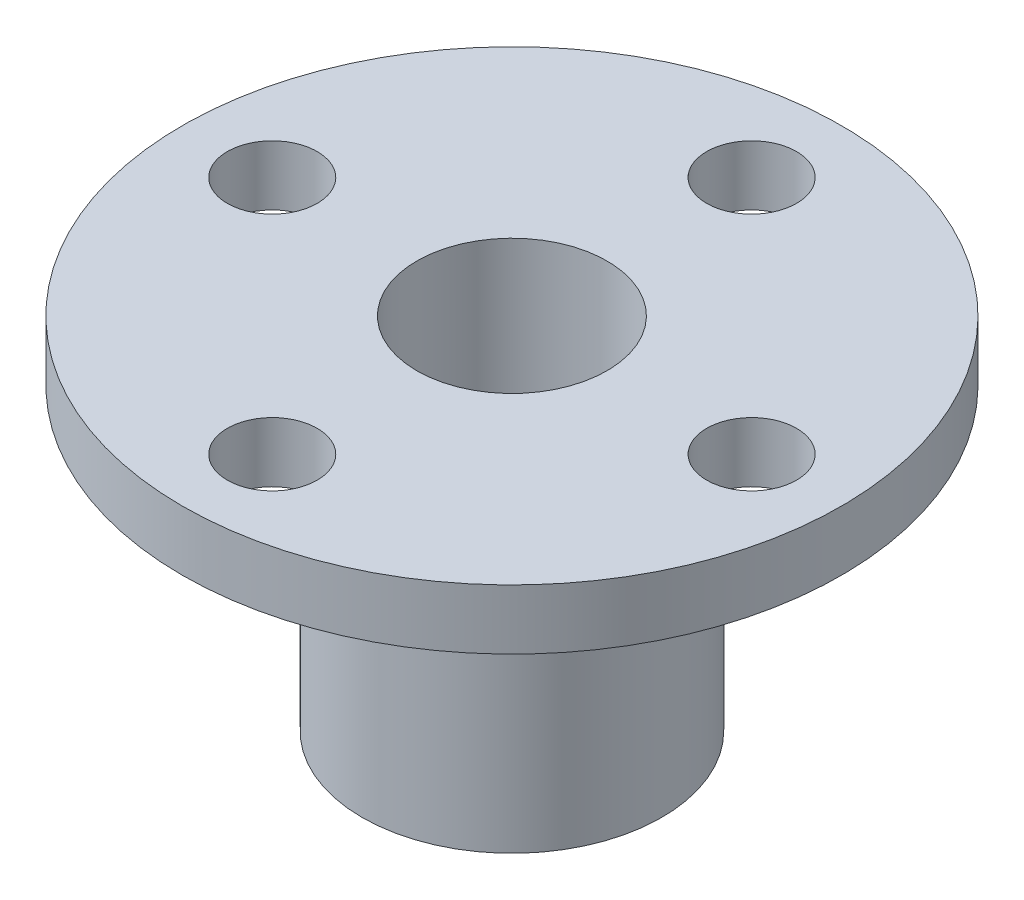
ISO-10303-21;
HEADER;
FILE_DESCRIPTION(('STEP AP214'),'2;1');
FILE_NAME('part.step','',(''),(''),'','','');
FILE_SCHEMA(('AUTOMOTIVE_DESIGN { 1 0 10303 214 1 1 1 1 }'));
ENDSEC;
DATA;
#1=APPLICATION_CONTEXT('core data for automotive mechanical design processes');
#2=APPLICATION_PROTOCOL_DEFINITION('international standard','automotive_design',2000,#1);
#3=PRODUCT_CONTEXT('',#1,'mechanical');
#4=PRODUCT('Part','Part','',(#3));
#5=PRODUCT_RELATED_PRODUCT_CATEGORY('part','',(#4));
#6=PRODUCT_DEFINITION_FORMATION('','',#4);
#7=PRODUCT_DEFINITION_CONTEXT('part definition',#1,'design');
#8=PRODUCT_DEFINITION('design','',#6,#7);
#9=PRODUCT_DEFINITION_SHAPE('','',#8);
#10=(LENGTH_UNIT() NAMED_UNIT(*) SI_UNIT(.MILLI.,.METRE.));
#11=(NAMED_UNIT(*) PLANE_ANGLE_UNIT() SI_UNIT($,.RADIAN.));
#12=(NAMED_UNIT(*) SI_UNIT($,.STERADIAN.) SOLID_ANGLE_UNIT());
#13=UNCERTAINTY_MEASURE_WITH_UNIT(LENGTH_MEASURE(1.E-05),#10,'distance_accuracy_value','');
#14=(GEOMETRIC_REPRESENTATION_CONTEXT(3) GLOBAL_UNCERTAINTY_ASSIGNED_CONTEXT((#13)) GLOBAL_UNIT_ASSIGNED_CONTEXT((#10,
#11,#12)) REPRESENTATION_CONTEXT('',''));
#15=CARTESIAN_POINT('',(0.,0.,0.));
#16=DIRECTION('',(0.,0.,1.));
#17=DIRECTION('',(1.,0.,0.));
#18=AXIS2_PLACEMENT_3D('',#15,#16,#17);
#19=CARTESIAN_POINT('',(0.,12.,0.));
#20=DIRECTION('',(0.,-1.,0.));
#21=DIRECTION('',(0.,0.,-1.));
#22=AXIS2_PLACEMENT_3D('',#19,#20,#21);
#23=CYLINDRICAL_SURFACE('',#22,5.);
#24=CARTESIAN_POINT('',(-2.31202417441306,3.500000112,-4.43334458585497));
#25=CARTESIAN_POINT('',(-2.31202549942293,3.58219466243882,-4.43334446318807));
#26=CARTESIAN_POINT('',(-2.31833638489113,3.6643993411338,-4.43006995781901));
#27=CARTESIAN_POINT('',(-2.34321559717994,3.82640537148671,-4.41695966316735));
#28=CARTESIAN_POINT('',(-2.36178801955003,3.90620591080794,-4.40712168156711));
#29=CARTESIAN_POINT('',(-2.41012639449827,4.06103485724733,-4.38087199438878));
#30=CARTESIAN_POINT('',(-2.43987372797232,4.13607096086672,-4.36447122047532));
#31=CARTESIAN_POINT('',(-2.50910127555069,4.27962206956173,-4.32504236855152));
#32=CARTESIAN_POINT('',(-2.5485829466275,4.34813609632548,-4.30201329837435));
#33=CARTESIAN_POINT('',(-2.636816060183,4.47886653233031,-4.24852112305575));
#34=CARTESIAN_POINT('',(-2.68580083537678,4.5408460417147,-4.21786379492083));
#35=CARTESIAN_POINT('',(-2.79025208635728,4.65463809882842,-4.14950403477006));
#36=CARTESIAN_POINT('',(-2.84571939385381,4.70644933967767,-4.1118006983778));
#37=CARTESIAN_POINT('',(-2.96222634925548,4.79946285226967,-4.02870100905597));
#38=CARTESIAN_POINT('',(-3.02335751045674,4.84042357834181,-3.98316169150373));
#39=CARTESIAN_POINT('',(-3.14784118309348,4.9089874154291,-3.88552985734805));
#40=CARTESIAN_POINT('',(-3.21119321228797,4.93659340726878,-3.83343875712392));
#41=CARTESIAN_POINT('',(-3.33595485274791,4.9768801600074,-3.72532159422989));
#42=CARTESIAN_POINT('',(-3.39736818700763,4.98996528708777,-3.66945072405293));
#43=CARTESIAN_POINT('',(-3.51800486213996,5.0021174846796,-3.55395675397155));
#44=CARTESIAN_POINT('',(-3.57722866037419,5.0011874995153,-3.49433444479822));
#45=CARTESIAN_POINT('',(-3.68987212284126,4.98560729131133,-3.37510896758464));
#46=CARTESIAN_POINT('',(-3.74341656555431,4.97139496574636,-3.31556566237646));
#47=CARTESIAN_POINT('',(-3.84553266225358,4.93036882262428,-3.19656529599339));
#48=CARTESIAN_POINT('',(-3.89410400108437,4.90355420703632,-3.1371082405194));
#49=CARTESIAN_POINT('',(-3.98596060909705,4.83778813294174,-3.01956152576072));
#50=CARTESIAN_POINT('',(-4.02917772174205,4.79869895256468,-2.96149585841079));
#51=CARTESIAN_POINT('',(-4.10918213174248,4.70960230066398,-2.84945061349041));
#52=CARTESIAN_POINT('',(-4.14596789992589,4.65959223883712,-2.79547200942037));
#53=CARTESIAN_POINT('',(-4.21419803162387,4.54780239800341,-2.691570132292));
#54=CARTESIAN_POINT('',(-4.24538182840745,4.48564322793666,-2.64188339808442));
#55=CARTESIAN_POINT('',(-4.30056428791281,4.35249012518576,-2.55107384986256));
#56=CARTESIAN_POINT('',(-4.32456223664918,4.28149531558445,-2.50995188696694));
#57=CARTESIAN_POINT('',(-4.36562000216245,4.13176066713603,-2.43784893375301));
#58=CARTESIAN_POINT('',(-4.3826110813607,4.05295308802471,-2.40696896818131));
#59=CARTESIAN_POINT('',(-4.40937475906003,3.8903929202142,-2.35758610040724));
#60=CARTESIAN_POINT('',(-4.41914971248739,3.8066419543949,-2.33907916055082));
#61=CARTESIAN_POINT('',(-4.43129411113088,3.63991775988073,-2.31598735677623));
#62=CARTESIAN_POINT('',(-4.43392599968392,3.55703189415707,-2.31090929044338));
#63=CARTESIAN_POINT('',(-4.43254936639928,3.39152721287025,-2.31354901107095));
#64=CARTESIAN_POINT('',(-4.42854177409488,3.3089083615473,-2.32126500685131));
#65=CARTESIAN_POINT('',(-4.41406688537284,3.1485117274029,-2.34866782198895));
#66=CARTESIAN_POINT('',(-4.40377010820637,3.07066393880063,-2.36803844773727));
#67=CARTESIAN_POINT('',(-4.37683344831705,2.91959840772447,-2.41746060562369));
#68=CARTESIAN_POINT('',(-4.36019258619421,2.84638138218371,-2.4475137868865));
#69=CARTESIAN_POINT('',(-4.31998197247072,2.70448262779798,-2.51782310486844));
#70=CARTESIAN_POINT('',(-4.29623823884611,2.63597536865816,-2.55833143685246));
#71=CARTESIAN_POINT('',(-4.24195840239585,2.50736197920264,-2.64735757745196));
#72=CARTESIAN_POINT('',(-4.21142067347663,2.44725786573648,-2.69587730281841));
#73=CARTESIAN_POINT('',(-4.14229622234859,2.33481967346355,-2.80097805981982));
#74=CARTESIAN_POINT('',(-4.10344922355428,2.28286444829127,-2.85779422020612));
#75=CARTESIAN_POINT('',(-4.01870727216013,2.19103337259757,-2.97577877246632));
#76=CARTESIAN_POINT('',(-3.97281266974601,2.15115692219098,-3.03694694801359));
#77=CARTESIAN_POINT('',(-3.87494178797113,2.08500003850884,-3.16085511688787));
#78=CARTESIAN_POINT('',(-3.82301465542071,2.05861805167433,-3.22357952970589));
#79=CARTESIAN_POINT('',(-3.7138590071855,2.01993914691165,-3.34875151800136));
#80=CARTESIAN_POINT('',(-3.65663201336301,2.00763819906583,-3.41119916758784));
#81=CARTESIAN_POINT('',(-3.54070823169406,1.99777701991018,-3.53130065564012));
#82=CARTESIAN_POINT('',(-3.48215291350954,1.9996673682435,-3.58904649265504));
#83=CARTESIAN_POINT('',(-3.36332028582923,2.01682169592389,-3.70063777193117));
#84=CARTESIAN_POINT('',(-3.30304307415707,2.0320849169919,-3.75448343515565));
#85=CARTESIAN_POINT('',(-3.18337766053787,2.07521172544236,-3.85645255363714));
#86=CARTESIAN_POINT('',(-3.12398686280542,2.10293824511586,-3.90463124709361));
#87=CARTESIAN_POINT('',(-3.00739314670923,2.17008198014908,-3.99512692528447));
#88=CARTESIAN_POINT('',(-2.95019058963226,2.20950111667913,-4.03744294506723));
#89=CARTESIAN_POINT('',(-2.83814117386164,2.30037352572427,-4.11701720553163));
#90=CARTESIAN_POINT('',(-2.78342825653659,2.35217149947148,-4.15407028684386));
#91=CARTESIAN_POINT('',(-2.68042809577496,2.46571046048475,-4.22126694611445));
#92=CARTESIAN_POINT('',(-2.63214271041002,2.52745431155503,-4.25140852790744));
#93=CARTESIAN_POINT('',(-2.54264572526368,2.66134085549778,-4.30555164221764));
#94=CARTESIAN_POINT('',(-2.50168784776831,2.73373863263396,-4.3293433991486));
#95=CARTESIAN_POINT('',(-2.43066703634383,2.8855552578498,-4.36961488943567));
#96=CARTESIAN_POINT('',(-2.40059886780211,2.96497070967923,-4.3860981368019));
#97=CARTESIAN_POINT('',(-2.35555560514324,3.11974052386268,-4.41043544590183));
#98=CARTESIAN_POINT('',(-2.33930220041448,3.19460874302033,-4.41902859408629));
#99=CARTESIAN_POINT('',(-2.31753694234156,3.34631532644478,-4.43048264682537));
#100=CARTESIAN_POINT('',(-2.31202293561082,3.42315329262089,-4.43334470054093));
#101=CARTESIAN_POINT('',(-2.31202417441306,3.500000112,-4.43334458585497));
#102=B_SPLINE_CURVE_WITH_KNOTS('',3,(#24,#25,#26,#27,#28,#29,#30,#31,#32,#33,#34,#35,#36,#37,
#38,#39,#40,#41,#42,#43,#44,#45,#46,#47,#48,#49,#50,#51,#52,#53,#54,#55,#56,#57,#58,#59,#60,#61,
#62,#63,#64,#65,#66,#67,#68,#69,#70,#71,#72,#73,#74,#75,#76,#77,#78,#79,#80,#81,#82,#83,#84,#85,
#86,#87,#88,#89,#90,#91,#92,#93,#94,#95,#96,#97,#98,#99,#100,#101),.UNSPECIFIED.,.T.,.F.,(4,2,2,
2,2,2,2,2,2,2,2,2,2,2,2,2,2,2,2,2,2,2,2,2,2,2,2,2,2,2,2,2,2,2,2,2,2,2,4),(0.,0.246300173389645,
0.492682656627625,0.738656436837478,0.984667055180276,1.23773153799973,1.49082852474544,
1.74915944741594,2.00743461919942,2.25832147276752,2.50915562023271,2.75200134631458,
2.99486245249785,3.2405521943363,3.48630027427801,3.7415215868586,3.99676824980476,
4.25446251598277,4.51207264842904,4.76008095778362,5.00805454868627,5.24958611399404,
5.49115498205993,5.73920749722107,5.98731944594718,6.24479525616393,6.50225827690007,
6.75775413026906,7.01317684380285,7.25876326723042,7.504335766126,7.747271211504,
7.99024659483157,8.24099652819104,8.49181879167775,8.75011667065351,9.00829022219503,
9.23861183319295,9.46888725700718),.UNSPECIFIED.);
#103=CARTESIAN_POINT('',(-2.31202417441306,3.500000112,-4.43334458585497));
#104=VERTEX_POINT('',#103);
#105=EDGE_CURVE('E92',#104,#104,#102,.T.);
#106=ORIENTED_EDGE('',*,*,#105,.T.);
#107=EDGE_LOOP('',(#106));
#108=FACE_BOUND('',#107,.T.);
#109=CARTESIAN_POINT('',(0.,0.,0.));
#110=DIRECTION('',(0.,1.,0.));
#111=DIRECTION('',(0.,0.,1.));
#112=AXIS2_PLACEMENT_3D('',#109,#110,#111);
#113=CIRCLE('',#112,5.);
#114=CARTESIAN_POINT('',(0.,0.,5.));
#115=VERTEX_POINT('',#114);
#116=EDGE_CURVE('E51',#115,#115,#113,.T.);
#117=ORIENTED_EDGE('',*,*,#116,.T.);
#118=EDGE_LOOP('',(#117));
#119=FACE_BOUND('',#118,.T.);
#120=CARTESIAN_POINT('',(0.,9.999999936,0.));
#121=DIRECTION('',(0.,1.,0.));
#122=DIRECTION('',(0.,0.,1.));
#123=AXIS2_PLACEMENT_3D('',#120,#121,#122);
#124=CIRCLE('',#123,5.);
#125=CARTESIAN_POINT('',(0.,9.999999936,5.));
#126=VERTEX_POINT('',#125);
#127=EDGE_CURVE('E10',#126,#126,#124,.T.);
#128=ORIENTED_EDGE('',*,*,#127,.F.);
#129=EDGE_LOOP('',(#128));
#130=FACE_BOUND('',#129,.T.);
#131=ADVANCED_FACE('F38',(#108,#119,#130),#23,.T.);
#132=CARTESIAN_POINT('',(0.,12.,0.));
#133=DIRECTION('',(0.,1.,0.));
#134=DIRECTION('',(0.,0.,1.));
#135=AXIS2_PLACEMENT_3D('',#132,#133,#134);
#136=PLANE('',#135);
#137=CARTESIAN_POINT('',(0.,12.,-8.));
#138=DIRECTION('',(0.,1.,0.));
#139=DIRECTION('',(0.,0.,1.));
#140=AXIS2_PLACEMENT_3D('',#137,#138,#139);
#141=CIRCLE('',#140,1.5);
#142=CARTESIAN_POINT('',(0.,12.,-6.5));
#143=VERTEX_POINT('',#142);
#144=EDGE_CURVE('E72',#143,#143,#141,.T.);
#145=ORIENTED_EDGE('',*,*,#144,.F.);
#146=EDGE_LOOP('',(#145));
#147=FACE_BOUND('',#146,.T.);
#148=CARTESIAN_POINT('',(8.00000000000023,12.,-2.25861965896257E-13));
#149=DIRECTION('',(0.,1.,0.));
#150=DIRECTION('',(0.,0.,1.));
#151=AXIS2_PLACEMENT_3D('',#148,#149,#150);
#152=CIRCLE('',#151,1.50000000000018);
#153=CARTESIAN_POINT('',(8.00000000000023,12.,1.49999999999995));
#154=VERTEX_POINT('',#153);
#155=EDGE_CURVE('E95',#154,#154,#152,.T.);
#156=ORIENTED_EDGE('',*,*,#155,.F.);
#157=EDGE_LOOP('',(#156));
#158=FACE_BOUND('',#157,.T.);
#159=CARTESIAN_POINT('',(4.52091325832258E-13,12.,8.));
#160=DIRECTION('',(0.,1.,0.));
#161=DIRECTION('',(0.,0.,1.));
#162=AXIS2_PLACEMENT_3D('',#159,#160,#161);
#163=CIRCLE('',#162,1.50000000000049);
#164=CARTESIAN_POINT('',(4.52091325832258E-13,12.,9.50000000000048));
#165=VERTEX_POINT('',#164);
#166=EDGE_CURVE('E91',#165,#165,#163,.T.);
#167=ORIENTED_EDGE('',*,*,#166,.F.);
#168=EDGE_LOOP('',(#167));
#169=FACE_BOUND('',#168,.T.);
#170=CARTESIAN_POINT('',(-7.99999999999977,12.,2.26841683335575E-13));
#171=DIRECTION('',(0.,1.,0.));
#172=DIRECTION('',(0.,0.,1.));
#173=AXIS2_PLACEMENT_3D('',#170,#171,#172);
#174=CIRCLE('',#173,1.50000000000036);
#175=CARTESIAN_POINT('',(-7.99999999999977,12.,1.50000000000059));
#176=VERTEX_POINT('',#175);
#177=EDGE_CURVE('E88',#176,#176,#174,.T.);
#178=ORIENTED_EDGE('',*,*,#177,.F.);
#179=EDGE_LOOP('',(#178));
#180=FACE_BOUND('',#179,.T.);
#181=CARTESIAN_POINT('',(0.,12.,0.));
#182=DIRECTION('',(0.,1.,0.));
#183=DIRECTION('',(0.,0.,1.));
#184=AXIS2_PLACEMENT_3D('',#181,#182,#183);
#185=CIRCLE('',#184,3.175);
#186=CARTESIAN_POINT('',(0.,12.,3.175));
#187=VERTEX_POINT('',#186);
#188=EDGE_CURVE('E56',#187,#187,#185,.T.);
#189=ORIENTED_EDGE('',*,*,#188,.F.);
#190=EDGE_LOOP('',(#189));
#191=FACE_BOUND('',#190,.T.);
#192=CARTESIAN_POINT('',(0.,12.,0.));
#193=DIRECTION('',(0.,1.,0.));
#194=DIRECTION('',(0.,0.,1.));
#195=AXIS2_PLACEMENT_3D('',#192,#193,#194);
#196=CIRCLE('',#195,11.);
#197=CARTESIAN_POINT('',(0.,12.,11.));
#198=VERTEX_POINT('',#197);
#199=EDGE_CURVE('E60',#198,#198,#196,.T.);
#200=ORIENTED_EDGE('',*,*,#199,.T.);
#201=EDGE_LOOP('',(#200));
#202=FACE_BOUND('',#201,.T.);
#203=ADVANCED_FACE('F137',(#147,#158,#169,#180,#191,#202),#136,.T.);
#204=CARTESIAN_POINT('',(0.,0.,0.));
#205=DIRECTION('',(0.,1.,0.));
#206=DIRECTION('',(0.,0.,1.));
#207=AXIS2_PLACEMENT_3D('',#204,#205,#206);
#208=PLANE('',#207);
#209=ORIENTED_EDGE('',*,*,#116,.F.);
#210=EDGE_LOOP('',(#209));
#211=FACE_BOUND('',#210,.T.);
#212=CARTESIAN_POINT('',(0.,0.,0.));
#213=DIRECTION('',(0.,1.,0.));
#214=DIRECTION('',(0.,0.,1.));
#215=AXIS2_PLACEMENT_3D('',#212,#213,#214);
#216=CIRCLE('',#215,3.175);
#217=CARTESIAN_POINT('',(0.,0.,3.175));
#218=VERTEX_POINT('',#217);
#219=EDGE_CURVE('E64',#218,#218,#216,.T.);
#220=ORIENTED_EDGE('',*,*,#219,.T.);
#221=EDGE_LOOP('',(#220));
#222=FACE_BOUND('',#221,.T.);
#223=ADVANCED_FACE('F135',(#211,#222),#208,.F.);
#224=CARTESIAN_POINT('',(0.,12.,0.));
#225=DIRECTION('',(0.,-1.,0.));
#226=DIRECTION('',(0.,0.,-1.));
#227=AXIS2_PLACEMENT_3D('',#224,#225,#226);
#228=CYLINDRICAL_SURFACE('',#227,3.175);
#229=CARTESIAN_POINT('',(-0.918054636796785,3.500000112,-3.03937504823869));
#230=CARTESIAN_POINT('',(-0.91806195460497,3.57881086177831,-3.03937562798375));
#231=CARTESIAN_POINT('',(-0.924864467810442,3.65773572855579,-3.03734367475689));
#232=CARTESIAN_POINT('',(-0.951533066371238,3.81321478811824,-3.02909121248637));
#233=CARTESIAN_POINT('',(-0.971429547733901,3.88976302984727,-3.02286095680186));
#234=CARTESIAN_POINT('',(-1.02265847995837,4.03795280043785,-3.00591280121772));
#235=CARTESIAN_POINT('',(-1.05393516926678,4.10961626503055,-2.99521674609923));
#236=CARTESIAN_POINT('',(-1.12602580832996,4.24692952514784,-2.96886492266212));
#237=CARTESIAN_POINT('',(-1.16683935231543,4.31257957636272,-2.95320936534783));
#238=CARTESIAN_POINT('',(-1.25934242218381,4.44132338321808,-2.91502323178688));
#239=CARTESIAN_POINT('',(-1.31160947008901,4.50387802849608,-2.89207320723516));
#240=CARTESIAN_POINT('',(-1.42261884536473,4.61959158072994,-2.8391130154373));
#241=CARTESIAN_POINT('',(-1.48136410229458,4.67274620831015,-2.80909964700835));
#242=CARTESIAN_POINT('',(-1.60664415062607,4.77118952899576,-2.73947861466615));
#243=CARTESIAN_POINT('',(-1.67343368597481,4.81583465254263,-2.69941174882017));
#244=CARTESIAN_POINT('',(-1.80890084083704,4.89153767658087,-2.61056435872828));
#245=CARTESIAN_POINT('',(-1.87757737022415,4.92260325365043,-2.56178877958017));
#246=CARTESIAN_POINT('',(-2.00943742275556,4.96819447782333,-2.4595304730513));
#247=CARTESIAN_POINT('',(-2.07268892656779,4.98365995932765,-2.40655625206087));
#248=CARTESIAN_POINT('',(-2.19579955771474,5.0006868582649,-2.29477399307958));
#249=CARTESIAN_POINT('',(-2.25566047403607,5.00225567723767,-2.2359690774704));
#250=CARTESIAN_POINT('',(-2.36545677148464,4.99185326768626,-2.11923646623584));
#251=CARTESIAN_POINT('',(-2.415802056777,4.98092652870428,-2.06159681419546));
#252=CARTESIAN_POINT('',(-2.51071973226122,4.94768467195665,-1.94488331964702));
#253=CARTESIAN_POINT('',(-2.55529169303696,4.92536870767704,-1.8858093708445));
#254=CARTESIAN_POINT('',(-2.63867926978607,4.86978196700357,-1.76729436829114));
#255=CARTESIAN_POINT('',(-2.67740007376503,4.83635415840214,-1.70786079266511));
#256=CARTESIAN_POINT('',(-2.74820377156194,4.75968112068583,-1.59143048257601));
#257=CARTESIAN_POINT('',(-2.78028422627132,4.71643229634078,-1.53443464961276));
#258=CARTESIAN_POINT('',(-2.84058128957726,4.61701792026517,-1.41995187381655));
#259=CARTESIAN_POINT('',(-2.86822164693023,4.56005752140971,-1.36285089329852));
#260=CARTESIAN_POINT('',(-2.91660624051917,4.43699721030606,-1.25597829688688));
#261=CARTESIAN_POINT('',(-2.93734615358962,4.37089160511218,-1.20621128659956));
#262=CARTESIAN_POINT('',(-2.97355292354999,4.227172283511,-1.11408584757473));
#263=CARTESIAN_POINT('',(-2.98868980545975,4.1491390849906,-1.07224671907911));
#264=CARTESIAN_POINT('',(-3.012878751287,3.98628388137507,-1.00228330901402));
#265=CARTESIAN_POINT('',(-3.02193654620651,3.90146835493583,-0.974146116961316));
#266=CARTESIAN_POINT('',(-3.03408939151558,3.73425383430413,-0.93557940048228));
#267=CARTESIAN_POINT('',(-3.03758380231899,3.65215768496145,-0.92397097865873));
#268=CARTESIAN_POINT('',(-3.04010353335008,3.4871636669207,-0.915653070719101));
#269=CARTESIAN_POINT('',(-3.03913131713423,3.40426626532377,-0.918935371651247));
#270=CARTESIAN_POINT('',(-3.03296101512999,3.24815901269297,-0.939073892012177));
#271=CARTESIAN_POINT('',(-3.0281618475161,3.17476197847212,-0.954647383819657));
#272=CARTESIAN_POINT('',(-3.01459782638847,3.03153647525468,-0.996648474405836));
#273=CARTESIAN_POINT('',(-3.0058318414383,2.96170903072375,-1.02307916973447));
#274=CARTESIAN_POINT('',(-2.9834501280834,2.82396429517508,-1.08666092422948));
#275=CARTESIAN_POINT('',(-2.9696291433729,2.75628410664584,-1.12425066222886));
#276=CARTESIAN_POINT('',(-2.93669562457092,2.62761026839796,-1.2076643735718));
#277=CARTESIAN_POINT('',(-2.9175804493704,2.56661997731978,-1.25349245275578));
#278=CARTESIAN_POINT('',(-2.8710570839251,2.44604886642114,-1.35691158683));
#279=CARTESIAN_POINT('',(-2.84296795341283,2.38736107905927,-1.41524205020779));
#280=CARTESIAN_POINT('',(-2.77888088156826,2.28083387038384,-1.53726801364423));
#281=CARTESIAN_POINT('',(-2.74288112626685,2.23299694237993,-1.60096474216104));
#282=CARTESIAN_POINT('',(-2.66193647397423,2.14893667233139,-1.73226912517797));
#283=CARTESIAN_POINT('',(-2.61685398622304,2.11291763265559,-1.79992392111212));
#284=CARTESIAN_POINT('',(-2.51839492274492,2.05513413543116,-1.93527603042734));
#285=CARTESIAN_POINT('',(-2.46502487614053,2.03335852638593,-2.00297326891077));
#286=CARTESIAN_POINT('',(-2.35599215872987,2.0063611715933,-2.12986456591638));
#287=CARTESIAN_POINT('',(-2.30090973649,1.99988992852596,-2.18929234115422));
#288=CARTESIAN_POINT('',(-2.18634802789374,2.00011294344685,-2.30370418231528));
#289=CARTESIAN_POINT('',(-2.12686997302949,2.00680352733899,-2.35868948388501));
#290=CARTESIAN_POINT('',(-2.00889903980146,2.03229158131871,-2.45980948980441));
#291=CARTESIAN_POINT('',(-1.95052967728769,2.0504080862875,-2.50626351310717));
#292=CARTESIAN_POINT('',(-1.8335808421122,2.0973789753119,-2.59305090929951));
#293=CARTESIAN_POINT('',(-1.77500133748173,2.1262350682992,-2.63338330664964));
#294=CARTESIAN_POINT('',(-1.65688317022058,2.19526515887375,-2.70933871237185));
#295=CARTESIAN_POINT('',(-1.5974202851045,2.23589066699835,-2.74466751428429));
#296=CARTESIAN_POINT('',(-1.48227212798994,2.32671574049034,-2.80852928108125));
#297=CARTESIAN_POINT('',(-1.42658858694526,2.376919653219,-2.83705914684976));
#298=CARTESIAN_POINT('',(-1.31619536197957,2.490715595288,-2.89003991301074));
#299=CARTESIAN_POINT('',(-1.26201881702331,2.55510369089938,-2.91389726529812));
#300=CARTESIAN_POINT('',(-1.16294796406351,2.69268792070363,-2.95483650973886));
#301=CARTESIAN_POINT('',(-1.11806048097938,2.76589046908348,-2.97191342853151));
#302=CARTESIAN_POINT('',(-1.03963201740613,2.92076764939445,-3.00026069519805));
#303=CARTESIAN_POINT('',(-1.00628747860851,3.00256072154388,-3.01143207362772));
#304=CARTESIAN_POINT('',(-0.95475891488795,3.17118808119646,-3.0281703048948));
#305=CARTESIAN_POINT('',(-0.936524004047283,3.25800438584451,-3.03375598240653));
#306=CARTESIAN_POINT('',(-0.923814884586327,3.37130545679435,-3.03762961929532));
#307=CARTESIAN_POINT('',(-0.921658562918243,3.39698828666072,-3.0382844760019));
#308=CARTESIAN_POINT('',(-0.91877720555548,3.44844337367365,-3.03915710674759));
#309=CARTESIAN_POINT('',(-0.918052242632852,3.47421563530031,-3.03937485856376));
#310=CARTESIAN_POINT('',(-0.918054636796785,3.500000112,-3.03937504823869));
#311=B_SPLINE_CURVE_WITH_KNOTS('',3,(#229,#230,#231,#232,#233,#234,#235,#236,#237,#238,#239,
#240,#241,#242,#243,#244,#245,#246,#247,#248,#249,#250,#251,#252,#253,#254,#255,#256,#257,#258,
#259,#260,#261,#262,#263,#264,#265,#266,#267,#268,#269,#270,#271,#272,#273,#274,#275,#276,#277,
#278,#279,#280,#281,#282,#283,#284,#285,#286,#287,#288,#289,#290,#291,#292,#293,#294,#295,#296,
#297,#298,#299,#300,#301,#302,#303,#304,#305,#306,#307,#308,#309,#310),.UNSPECIFIED.,.T.,.F.,(4,
2,2,2,2,2,2,2,2,2,2,2,2,2,2,2,2,2,2,2,2,2,2,2,2,2,2,2,2,2,2,2,2,2,2,2,2,2,2,2,4),(0.,
0.236323878351855,0.47319829730292,0.708927356808968,0.944646388459196,1.19762433026621,
1.45071714592256,1.71864290509776,1.98641700815375,2.23687159670054,2.48719278191089,
2.71802825398504,2.94888088560359,3.18314540635514,3.41749582418116,3.67216717111942,
3.92699777190001,4.1950691134397,4.46288737691545,4.71043843225609,4.95785296785501,
5.1823981293449,5.40700737718989,5.6419884922406,5.87708704395837,6.13804656476777,
6.39906598822989,6.66438539742361,6.92949683276089,7.17207900006045,7.41459346067114,
7.64386694473124,7.87317692743155,8.11282265027876,8.35257740126843,8.61378888036911,
8.87519160234715,9.14084636277169,9.40560277747927,9.48291682125321,9.56023479566767),.UNSPECIFIED.);
#312=CARTESIAN_POINT('',(-0.918054636796785,3.500000112,-3.03937504823869));
#313=VERTEX_POINT('',#312);
#314=EDGE_CURVE('E42',#313,#313,#311,.T.);
#315=ORIENTED_EDGE('',*,*,#314,.F.);
#316=EDGE_LOOP('',(#315));
#317=FACE_BOUND('',#316,.T.);
#318=ORIENTED_EDGE('',*,*,#188,.T.);
#319=EDGE_LOOP('',(#318));
#320=FACE_BOUND('',#319,.T.);
#321=ORIENTED_EDGE('',*,*,#219,.F.);
#322=EDGE_LOOP('',(#321));
#323=FACE_BOUND('',#322,.T.);
#324=ADVANCED_FACE('F130',(#317,#320,#323),#228,.F.);
#325=CARTESIAN_POINT('',(0.,9.999999936,0.));
#326=DIRECTION('',(0.,1.,0.));
#327=DIRECTION('',(0.,0.,1.));
#328=AXIS2_PLACEMENT_3D('',#325,#326,#327);
#329=PLANE('',#328);
#330=CARTESIAN_POINT('',(0.,9.999999936,-8.));
#331=DIRECTION('',(0.,1.,0.));
#332=DIRECTION('',(0.,0.,1.));
#333=AXIS2_PLACEMENT_3D('',#330,#331,#332);
#334=CIRCLE('',#333,1.5);
#335=CARTESIAN_POINT('',(0.,9.999999936,-6.5));
#336=VERTEX_POINT('',#335);
#337=EDGE_CURVE('E77',#336,#336,#334,.T.);
#338=ORIENTED_EDGE('',*,*,#337,.T.);
#339=EDGE_LOOP('',(#338));
#340=FACE_BOUND('',#339,.T.);
#341=CARTESIAN_POINT('',(8.00000000000023,9.999999936,-2.25861965896257E-13));
#342=DIRECTION('',(0.,1.,0.));
#343=DIRECTION('',(0.,0.,1.));
#344=AXIS2_PLACEMENT_3D('',#341,#342,#343);
#345=CIRCLE('',#344,1.50000000000018);
#346=CARTESIAN_POINT('',(8.00000000000023,9.999999936,1.49999999999995));
#347=VERTEX_POINT('',#346);
#348=EDGE_CURVE('E75',#347,#347,#345,.T.);
#349=ORIENTED_EDGE('',*,*,#348,.T.);
#350=EDGE_LOOP('',(#349));
#351=FACE_BOUND('',#350,.T.);
#352=CARTESIAN_POINT('',(4.52091325832258E-13,9.999999936,8.));
#353=DIRECTION('',(0.,1.,0.));
#354=DIRECTION('',(0.,0.,1.));
#355=AXIS2_PLACEMENT_3D('',#352,#353,#354);
#356=CIRCLE('',#355,1.50000000000049);
#357=CARTESIAN_POINT('',(4.52091325832258E-13,9.999999936,9.50000000000048));
#358=VERTEX_POINT('',#357);
#359=EDGE_CURVE('E71',#358,#358,#356,.T.);
#360=ORIENTED_EDGE('',*,*,#359,.T.);
#361=EDGE_LOOP('',(#360));
#362=FACE_BOUND('',#361,.T.);
#363=CARTESIAN_POINT('',(-7.99999999999977,9.999999936,2.26841683335575E-13));
#364=DIRECTION('',(0.,1.,0.));
#365=DIRECTION('',(0.,0.,1.));
#366=AXIS2_PLACEMENT_3D('',#363,#364,#365);
#367=CIRCLE('',#366,1.50000000000036);
#368=CARTESIAN_POINT('',(-7.99999999999977,9.999999936,1.50000000000059));
#369=VERTEX_POINT('',#368);
#370=EDGE_CURVE('E68',#369,#369,#367,.T.);
#371=ORIENTED_EDGE('',*,*,#370,.T.);
#372=EDGE_LOOP('',(#371));
#373=FACE_BOUND('',#372,.T.);
#374=CARTESIAN_POINT('',(0.,9.999999936,0.));
#375=DIRECTION('',(0.,1.,0.));
#376=DIRECTION('',(0.,0.,1.));
#377=AXIS2_PLACEMENT_3D('',#374,#375,#376);
#378=CIRCLE('',#377,11.);
#379=CARTESIAN_POINT('',(0.,9.999999936,11.));
#380=VERTEX_POINT('',#379);
#381=EDGE_CURVE('E66',#380,#380,#378,.T.);
#382=ORIENTED_EDGE('',*,*,#381,.F.);
#383=EDGE_LOOP('',(#382));
#384=FACE_BOUND('',#383,.T.);
#385=ORIENTED_EDGE('',*,*,#127,.T.);
#386=EDGE_LOOP('',(#385));
#387=FACE_BOUND('',#386,.T.);
#388=ADVANCED_FACE('F127',(#340,#351,#362,#373,#384,#387),#329,.F.);
#389=CARTESIAN_POINT('',(0.,9.999999936,0.));
#390=DIRECTION('',(0.,1.,0.));
#391=DIRECTION('',(0.,0.,1.));
#392=AXIS2_PLACEMENT_3D('',#389,#390,#391);
#393=CYLINDRICAL_SURFACE('',#392,11.);
#394=ORIENTED_EDGE('',*,*,#381,.T.);
#395=EDGE_LOOP('',(#394));
#396=FACE_BOUND('',#395,.T.);
#397=ORIENTED_EDGE('',*,*,#199,.F.);
#398=EDGE_LOOP('',(#397));
#399=FACE_BOUND('',#398,.T.);
#400=ADVANCED_FACE('F125',(#396,#399),#393,.T.);
#401=CARTESIAN_POINT('',(-7.99999999999977,0.,2.26841683335575E-13));
#402=DIRECTION('',(0.,1.,0.));
#403=DIRECTION('',(0.,0.,1.));
#404=AXIS2_PLACEMENT_3D('',#401,#402,#403);
#405=CYLINDRICAL_SURFACE('',#404,1.50000000000036);
#406=ORIENTED_EDGE('',*,*,#177,.T.);
#407=EDGE_LOOP('',(#406));
#408=FACE_BOUND('',#407,.T.);
#409=ORIENTED_EDGE('',*,*,#370,.F.);
#410=EDGE_LOOP('',(#409));
#411=FACE_BOUND('',#410,.T.);
#412=ADVANCED_FACE('F121',(#408,#411),#405,.F.);
#413=CARTESIAN_POINT('',(4.52091325832258E-13,0.,8.));
#414=DIRECTION('',(0.,1.,0.));
#415=DIRECTION('',(0.,0.,1.));
#416=AXIS2_PLACEMENT_3D('',#413,#414,#415);
#417=CYLINDRICAL_SURFACE('',#416,1.50000000000049);
#418=ORIENTED_EDGE('',*,*,#166,.T.);
#419=EDGE_LOOP('',(#418));
#420=FACE_BOUND('',#419,.T.);
#421=ORIENTED_EDGE('',*,*,#359,.F.);
#422=EDGE_LOOP('',(#421));
#423=FACE_BOUND('',#422,.T.);
#424=ADVANCED_FACE('F117',(#420,#423),#417,.F.);
#425=CARTESIAN_POINT('',(8.00000000000023,0.,-2.25861965896257E-13));
#426=DIRECTION('',(0.,1.,0.));
#427=DIRECTION('',(0.,0.,1.));
#428=AXIS2_PLACEMENT_3D('',#425,#426,#427);
#429=CYLINDRICAL_SURFACE('',#428,1.50000000000018);
#430=ORIENTED_EDGE('',*,*,#155,.T.);
#431=EDGE_LOOP('',(#430));
#432=FACE_BOUND('',#431,.T.);
#433=ORIENTED_EDGE('',*,*,#348,.F.);
#434=EDGE_LOOP('',(#433));
#435=FACE_BOUND('',#434,.T.);
#436=ADVANCED_FACE('F113',(#432,#435),#429,.F.);
#437=CARTESIAN_POINT('',(0.,0.,-8.));
#438=DIRECTION('',(0.,1.,0.));
#439=DIRECTION('',(0.,0.,1.));
#440=AXIS2_PLACEMENT_3D('',#437,#438,#439);
#441=CYLINDRICAL_SURFACE('',#440,1.5);
#442=ORIENTED_EDGE('',*,*,#144,.T.);
#443=EDGE_LOOP('',(#442));
#444=FACE_BOUND('',#443,.T.);
#445=ORIENTED_EDGE('',*,*,#337,.F.);
#446=EDGE_LOOP('',(#445));
#447=FACE_BOUND('',#446,.T.);
#448=ADVANCED_FACE('F108',(#444,#447),#441,.F.);
#449=CARTESIAN_POINT('',(-11.,3.500000112,-11.));
#450=DIRECTION('',(0.707106781186546,0.,0.707106781186549));
#451=DIRECTION('',(0.707106781186549,0.,-0.707106781186546));
#452=AXIS2_PLACEMENT_3D('',#449,#450,#451);
#453=CYLINDRICAL_SURFACE('',#452,1.500000048);
#454=ORIENTED_EDGE('',*,*,#314,.T.);
#455=EDGE_LOOP('',(#454));
#456=FACE_BOUND('',#455,.T.);
#457=ORIENTED_EDGE('',*,*,#105,.F.);
#458=EDGE_LOOP('',(#457));
#459=FACE_BOUND('',#458,.T.);
#460=ADVANCED_FACE('F104',(#456,#459),#453,.F.);
#461=CLOSED_SHELL('',(#131,#203,#223,#324,#388,#400,#412,#424,#436,#448,#460));
#462=MANIFOLD_SOLID_BREP('B2',#461);
#463=ADVANCED_BREP_SHAPE_REPRESENTATION('',(#18,#462),#14);
#464=SHAPE_DEFINITION_REPRESENTATION(#9,#463);
ENDSEC;
END-ISO-10303-21;
